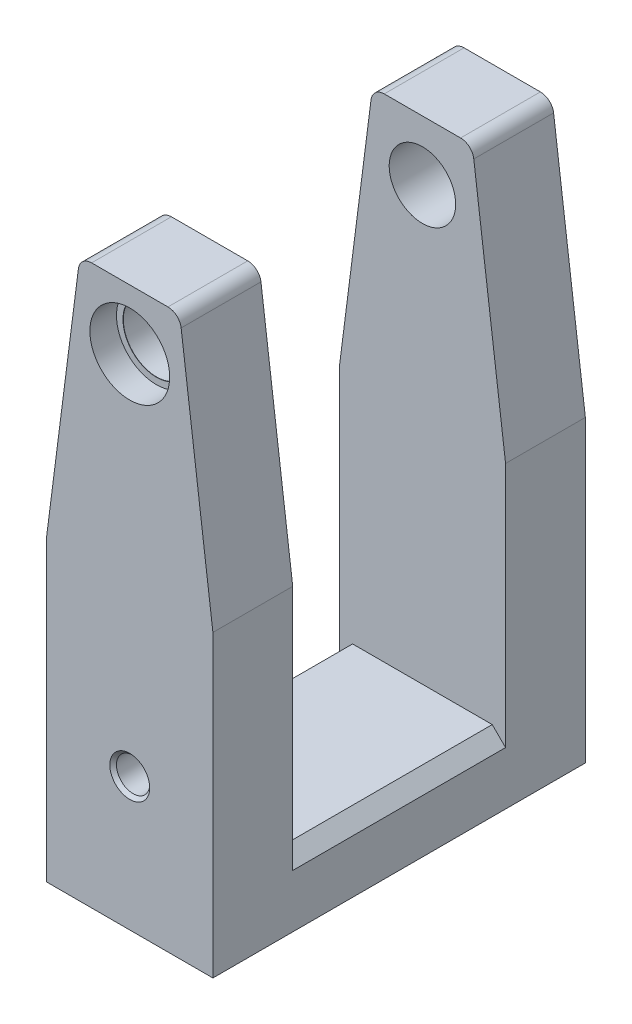
ISO-10303-21;
HEADER;
FILE_DESCRIPTION(('STEP AP214'),'2;1');
FILE_NAME('part.step','',(''),(''),'','','');
FILE_SCHEMA(('AUTOMOTIVE_DESIGN { 1 0 10303 214 1 1 1 1 }'));
ENDSEC;
DATA;
#1=APPLICATION_CONTEXT('core data for automotive mechanical design processes');
#2=APPLICATION_PROTOCOL_DEFINITION('international standard','automotive_design',2000,#1);
#3=PRODUCT_CONTEXT('',#1,'mechanical');
#4=PRODUCT('Part','Part','',(#3));
#5=PRODUCT_RELATED_PRODUCT_CATEGORY('part','',(#4));
#6=PRODUCT_DEFINITION_FORMATION('','',#4);
#7=PRODUCT_DEFINITION_CONTEXT('part definition',#1,'design');
#8=PRODUCT_DEFINITION('design','',#6,#7);
#9=PRODUCT_DEFINITION_SHAPE('','',#8);
#10=(LENGTH_UNIT() NAMED_UNIT(*) SI_UNIT(.MILLI.,.METRE.));
#11=(NAMED_UNIT(*) PLANE_ANGLE_UNIT() SI_UNIT($,.RADIAN.));
#12=(NAMED_UNIT(*) SI_UNIT($,.STERADIAN.) SOLID_ANGLE_UNIT());
#13=UNCERTAINTY_MEASURE_WITH_UNIT(LENGTH_MEASURE(1.E-05),#10,'distance_accuracy_value','');
#14=(GEOMETRIC_REPRESENTATION_CONTEXT(3) GLOBAL_UNCERTAINTY_ASSIGNED_CONTEXT((#13)) GLOBAL_UNIT_ASSIGNED_CONTEXT((#10,
#11,#12)) REPRESENTATION_CONTEXT('',''));
#15=CARTESIAN_POINT('',(0.,0.,0.));
#16=DIRECTION('',(0.,0.,1.));
#17=DIRECTION('',(1.,0.,0.));
#18=AXIS2_PLACEMENT_3D('',#15,#16,#17);
#19=CARTESIAN_POINT('',(7.5,84.,28.));
#20=DIRECTION('',(-0.991881664685851,-0.127164315985366,0.));
#21=DIRECTION('',(0.127164315985366,-0.991881664685851,0.));
#22=AXIS2_PLACEMENT_3D('',#19,#20,#21);
#23=PLANE('',#22);
#24=DIRECTION('',(-0.127164315985366,0.991881664685851,0.));
#25=VECTOR('',#24,1.);
#26=CARTESIAN_POINT('',(7.5,84.,16.));
#27=LINE('',#26,#25);
#28=CARTESIAN_POINT('',(12.5,45.,16.));
#29=VERTEX_POINT('',#28);
#30=CARTESIAN_POINT('',(7.72380402154221,82.2543286319707,16.));
#31=VERTEX_POINT('',#30);
#32=EDGE_CURVE('E305',#29,#31,#27,.T.);
#33=ORIENTED_EDGE('',*,*,#32,.T.);
#34=DIRECTION('',(0.,0.,-1.));
#35=VECTOR('',#34,1.);
#36=CARTESIAN_POINT('',(7.72380402154221,82.2543286319707,28.));
#37=LINE('',#36,#35);
#38=CARTESIAN_POINT('',(7.72380402154221,82.2543286319707,28.));
#39=VERTEX_POINT('',#38);
#40=EDGE_CURVE('E49',#31,#39,#37,.F.);
#41=ORIENTED_EDGE('',*,*,#40,.T.);
#42=DIRECTION('',(-0.127164315985366,0.99188166468585,0.));
#43=VECTOR('',#42,1.);
#44=CARTESIAN_POINT('',(7.5,84.,28.));
#45=LINE('',#44,#43);
#46=CARTESIAN_POINT('',(12.5,45.,28.));
#47=VERTEX_POINT('',#46);
#48=EDGE_CURVE('E310',#47,#39,#45,.T.);
#49=ORIENTED_EDGE('',*,*,#48,.F.);
#50=DIRECTION('',(0.,0.,-1.));
#51=VECTOR('',#50,1.);
#52=CARTESIAN_POINT('',(12.5,45.,28.));
#53=LINE('',#52,#51);
#54=EDGE_CURVE('E197',#47,#29,#53,.T.);
#55=ORIENTED_EDGE('',*,*,#54,.T.);
#56=EDGE_LOOP('',(#33,#41,#49,#55));
#57=FACE_BOUND('',#56,.T.);
#58=ADVANCED_FACE('F41',(#57),#23,.F.);
#59=CARTESIAN_POINT('',(-7.5,84.,28.));
#60=DIRECTION('',(0.,-1.,0.));
#61=DIRECTION('',(0.,0.,-1.));
#62=AXIS2_PLACEMENT_3D('',#59,#60,#61);
#63=PLANE('',#62);
#64=DIRECTION('',(1.,0.,0.));
#65=VECTOR('',#64,1.);
#66=CARTESIAN_POINT('',(-12.5,84.,16.));
#67=LINE('',#66,#65);
#68=CARTESIAN_POINT('',(-5.74004069217051,84.,16.));
#69=VERTEX_POINT('',#68);
#70=CARTESIAN_POINT('',(5.74004069217051,84.,16.));
#71=VERTEX_POINT('',#70);
#72=EDGE_CURVE('E287',#69,#71,#67,.T.);
#73=ORIENTED_EDGE('',*,*,#72,.F.);
#74=DIRECTION('',(0.,0.,-1.));
#75=VECTOR('',#74,1.);
#76=CARTESIAN_POINT('',(-5.74004069217051,84.,28.));
#77=LINE('',#76,#75);
#78=CARTESIAN_POINT('',(-5.74004069217051,84.,28.));
#79=VERTEX_POINT('',#78);
#80=EDGE_CURVE('E63',#69,#79,#77,.F.);
#81=ORIENTED_EDGE('',*,*,#80,.T.);
#82=DIRECTION('',(-1.,0.,0.));
#83=VECTOR('',#82,1.);
#84=CARTESIAN_POINT('',(-7.5,84.,28.));
#85=LINE('',#84,#83);
#86=CARTESIAN_POINT('',(5.74004069217051,84.,28.));
#87=VERTEX_POINT('',#86);
#88=EDGE_CURVE('E274',#87,#79,#85,.T.);
#89=ORIENTED_EDGE('',*,*,#88,.F.);
#90=DIRECTION('',(0.,0.,-1.));
#91=VECTOR('',#90,1.);
#92=CARTESIAN_POINT('',(5.74004069217051,84.,28.));
#93=LINE('',#92,#91);
#94=EDGE_CURVE('E261',#87,#71,#93,.T.);
#95=ORIENTED_EDGE('',*,*,#94,.T.);
#96=EDGE_LOOP('',(#73,#81,#89,#95));
#97=FACE_BOUND('',#96,.T.);
#98=ADVANCED_FACE('F289',(#97),#63,.F.);
#99=CARTESIAN_POINT('',(-12.5,45.,28.));
#100=DIRECTION('',(0.991881664685851,-0.127164315985366,0.));
#101=DIRECTION('',(0.127164315985366,0.991881664685851,0.));
#102=AXIS2_PLACEMENT_3D('',#99,#100,#101);
#103=PLANE('',#102);
#104=DIRECTION('',(-0.127164315985366,-0.99188166468585,0.));
#105=VECTOR('',#104,1.);
#106=CARTESIAN_POINT('',(-12.5,45.,28.));
#107=LINE('',#106,#105);
#108=CARTESIAN_POINT('',(-7.72380402154221,82.2543286319707,28.));
#109=VERTEX_POINT('',#108);
#110=CARTESIAN_POINT('',(-12.5,45.,28.));
#111=VERTEX_POINT('',#110);
#112=EDGE_CURVE('E272',#109,#111,#107,.T.);
#113=ORIENTED_EDGE('',*,*,#112,.F.);
#114=DIRECTION('',(0.,0.,-1.));
#115=VECTOR('',#114,1.);
#116=CARTESIAN_POINT('',(-7.72380402154221,82.2543286319707,28.));
#117=LINE('',#116,#115);
#118=CARTESIAN_POINT('',(-7.72380402154221,82.2543286319707,16.));
#119=VERTEX_POINT('',#118);
#120=EDGE_CURVE('E254',#109,#119,#117,.T.);
#121=ORIENTED_EDGE('',*,*,#120,.T.);
#122=DIRECTION('',(-0.127164315985366,-0.991881664685851,0.));
#123=VECTOR('',#122,1.);
#124=CARTESIAN_POINT('',(-12.5,45.,16.));
#125=LINE('',#124,#123);
#126=CARTESIAN_POINT('',(-12.5,45.,16.));
#127=VERTEX_POINT('',#126);
#128=EDGE_CURVE('E178',#119,#127,#125,.T.);
#129=ORIENTED_EDGE('',*,*,#128,.T.);
#130=DIRECTION('',(0.,0.,-1.));
#131=VECTOR('',#130,1.);
#132=CARTESIAN_POINT('',(-12.5,45.,28.));
#133=LINE('',#132,#131);
#134=EDGE_CURVE('E198',#111,#127,#133,.T.);
#135=ORIENTED_EDGE('',*,*,#134,.F.);
#136=EDGE_LOOP('',(#113,#121,#129,#135));
#137=FACE_BOUND('',#136,.T.);
#138=ADVANCED_FACE('F278',(#137),#103,.F.);
#139=CARTESIAN_POINT('',(12.5,45.,28.));
#140=DIRECTION('',(-1.,0.,0.));
#141=DIRECTION('',(0.,0.,1.));
#142=AXIS2_PLACEMENT_3D('',#139,#140,#141);
#143=PLANE('',#142);
#144=DIRECTION('',(0.,1.,0.));
#145=VECTOR('',#144,1.);
#146=CARTESIAN_POINT('',(12.5,84.,-16.));
#147=LINE('',#146,#145);
#148=CARTESIAN_POINT('',(12.5,8.,-16.));
#149=VERTEX_POINT('',#148);
#150=CARTESIAN_POINT('',(12.5,45.,-16.));
#151=VERTEX_POINT('',#150);
#152=EDGE_CURVE('E182',#149,#151,#147,.T.);
#153=ORIENTED_EDGE('',*,*,#152,.F.);
#154=DIRECTION('',(0.,0.,1.));
#155=VECTOR('',#154,1.);
#156=CARTESIAN_POINT('',(12.5,7.99999999999999,28.));
#157=LINE('',#156,#155);
#158=CARTESIAN_POINT('',(12.5,7.99999999999999,16.));
#159=VERTEX_POINT('',#158);
#160=EDGE_CURVE('E230',#149,#159,#157,.T.);
#161=ORIENTED_EDGE('',*,*,#160,.T.);
#162=DIRECTION('',(0.,-1.,0.));
#163=VECTOR('',#162,1.);
#164=CARTESIAN_POINT('',(12.5,84.,16.));
#165=LINE('',#164,#163);
#166=EDGE_CURVE('E190',#29,#159,#165,.T.);
#167=ORIENTED_EDGE('',*,*,#166,.F.);
#168=ORIENTED_EDGE('',*,*,#54,.F.);
#169=DIRECTION('',(0.,1.,0.));
#170=VECTOR('',#169,1.);
#171=CARTESIAN_POINT('',(12.5,45.,28.));
#172=LINE('',#171,#170);
#173=CARTESIAN_POINT('',(12.5,0.,28.));
#174=VERTEX_POINT('',#173);
#175=EDGE_CURVE('E307',#174,#47,#172,.T.);
#176=ORIENTED_EDGE('',*,*,#175,.F.);
#177=DIRECTION('',(0.,0.,-1.));
#178=VECTOR('',#177,1.);
#179=CARTESIAN_POINT('',(12.5,0.,28.));
#180=LINE('',#179,#178);
#181=CARTESIAN_POINT('',(12.5,0.,-28.));
#182=VERTEX_POINT('',#181);
#183=EDGE_CURVE('E317',#174,#182,#180,.T.);
#184=ORIENTED_EDGE('',*,*,#183,.T.);
#185=DIRECTION('',(0.,1.,0.));
#186=VECTOR('',#185,1.);
#187=CARTESIAN_POINT('',(12.5,45.,-28.));
#188=LINE('',#187,#186);
#189=CARTESIAN_POINT('',(12.5,45.,-28.));
#190=VERTEX_POINT('',#189);
#191=EDGE_CURVE('E196',#182,#190,#188,.T.);
#192=ORIENTED_EDGE('',*,*,#191,.T.);
#193=EDGE_CURVE('E172',#151,#190,#53,.T.);
#194=ORIENTED_EDGE('',*,*,#193,.F.);
#195=EDGE_LOOP('',(#153,#161,#167,#168,#176,#184,#192,#194));
#196=FACE_BOUND('',#195,.T.);
#197=ADVANCED_FACE('F193',(#196),#143,.F.);
#198=DIRECTION('',(-0.127164315985366,0.99188166468585,0.));
#199=VECTOR('',#198,1.);
#200=CARTESIAN_POINT('',(7.5,84.,-28.));
#201=LINE('',#200,#199);
#202=CARTESIAN_POINT('',(7.72380402154221,82.2543286319707,-28.));
#203=VERTEX_POINT('',#202);
#204=EDGE_CURVE('E319',#190,#203,#201,.T.);
#205=ORIENTED_EDGE('',*,*,#204,.T.);
#206=DIRECTION('',(0.,0.,-1.));
#207=VECTOR('',#206,1.);
#208=CARTESIAN_POINT('',(7.72380402154221,82.2543286319707,28.));
#209=LINE('',#208,#207);
#210=CARTESIAN_POINT('',(7.72380402154221,82.2543286319707,-16.));
#211=VERTEX_POINT('',#210);
#212=EDGE_CURVE('E175',#203,#211,#209,.F.);
#213=ORIENTED_EDGE('',*,*,#212,.T.);
#214=DIRECTION('',(0.127164315985366,-0.991881664685851,0.));
#215=VECTOR('',#214,1.);
#216=CARTESIAN_POINT('',(7.5,84.,-16.));
#217=LINE('',#216,#215);
#218=EDGE_CURVE('E167',#211,#151,#217,.T.);
#219=ORIENTED_EDGE('',*,*,#218,.T.);
#220=ORIENTED_EDGE('',*,*,#193,.T.);
#221=EDGE_LOOP('',(#205,#213,#219,#220));
#222=FACE_BOUND('',#221,.T.);
#223=ADVANCED_FACE('F170',(#222),#23,.F.);
#224=DIRECTION('',(1.,0.,0.));
#225=VECTOR('',#224,1.);
#226=CARTESIAN_POINT('',(-12.5,84.,-16.));
#227=LINE('',#226,#225);
#228=CARTESIAN_POINT('',(-5.74004069217051,84.,-16.));
#229=VERTEX_POINT('',#228);
#230=CARTESIAN_POINT('',(5.74004069217051,84.,-16.));
#231=VERTEX_POINT('',#230);
#232=EDGE_CURVE('E291',#229,#231,#227,.T.);
#233=ORIENTED_EDGE('',*,*,#232,.T.);
#234=DIRECTION('',(0.,0.,-1.));
#235=VECTOR('',#234,1.);
#236=CARTESIAN_POINT('',(5.74004069217051,84.,28.));
#237=LINE('',#236,#235);
#238=CARTESIAN_POINT('',(5.74004069217051,84.,-28.));
#239=VERTEX_POINT('',#238);
#240=EDGE_CURVE('E242',#231,#239,#237,.T.);
#241=ORIENTED_EDGE('',*,*,#240,.T.);
#242=DIRECTION('',(-1.,0.,0.));
#243=VECTOR('',#242,1.);
#244=CARTESIAN_POINT('',(-7.5,84.,-28.));
#245=LINE('',#244,#243);
#246=CARTESIAN_POINT('',(-5.74004069217051,84.,-28.));
#247=VERTEX_POINT('',#246);
#248=EDGE_CURVE('E321',#239,#247,#245,.T.);
#249=ORIENTED_EDGE('',*,*,#248,.T.);
#250=DIRECTION('',(0.,0.,-1.));
#251=VECTOR('',#250,1.);
#252=CARTESIAN_POINT('',(-5.74004069217051,84.,28.));
#253=LINE('',#252,#251);
#254=EDGE_CURVE('E240',#247,#229,#253,.F.);
#255=ORIENTED_EDGE('',*,*,#254,.T.);
#256=EDGE_LOOP('',(#233,#241,#249,#255));
#257=FACE_BOUND('',#256,.T.);
#258=ADVANCED_FACE('F382',(#257),#63,.F.);
#259=DIRECTION('',(0.127164315985366,0.991881664685851,0.));
#260=VECTOR('',#259,1.);
#261=CARTESIAN_POINT('',(-12.5,45.,-16.));
#262=LINE('',#261,#260);
#263=CARTESIAN_POINT('',(-12.5,45.,-16.));
#264=VERTEX_POINT('',#263);
#265=CARTESIAN_POINT('',(-7.72380402154221,82.2543286319707,-16.));
#266=VERTEX_POINT('',#265);
#267=EDGE_CURVE('E179',#264,#266,#262,.T.);
#268=ORIENTED_EDGE('',*,*,#267,.T.);
#269=DIRECTION('',(0.,0.,-1.));
#270=VECTOR('',#269,1.);
#271=CARTESIAN_POINT('',(-7.72380402154221,82.2543286319707,28.));
#272=LINE('',#271,#270);
#273=CARTESIAN_POINT('',(-7.72380402154221,82.2543286319707,-28.));
#274=VERTEX_POINT('',#273);
#275=EDGE_CURVE('E11',#266,#274,#272,.T.);
#276=ORIENTED_EDGE('',*,*,#275,.T.);
#277=DIRECTION('',(-0.127164315985366,-0.99188166468585,0.));
#278=VECTOR('',#277,1.);
#279=CARTESIAN_POINT('',(-12.5,45.,-28.));
#280=LINE('',#279,#278);
#281=CARTESIAN_POINT('',(-12.5,45.,-28.));
#282=VERTEX_POINT('',#281);
#283=EDGE_CURVE('E324',#274,#282,#280,.T.);
#284=ORIENTED_EDGE('',*,*,#283,.T.);
#285=EDGE_CURVE('E203',#264,#282,#133,.T.);
#286=ORIENTED_EDGE('',*,*,#285,.F.);
#287=EDGE_LOOP('',(#268,#276,#284,#286));
#288=FACE_BOUND('',#287,.T.);
#289=ADVANCED_FACE('F389',(#288),#103,.F.);
#290=CARTESIAN_POINT('',(-12.5,0.,28.));
#291=DIRECTION('',(1.,0.,0.));
#292=DIRECTION('',(0.,0.,-1.));
#293=AXIS2_PLACEMENT_3D('',#290,#291,#292);
#294=PLANE('',#293);
#295=DIRECTION('',(0.,0.,-1.));
#296=VECTOR('',#295,1.);
#297=CARTESIAN_POINT('',(-12.5,8.00000000000001,28.));
#298=LINE('',#297,#296);
#299=CARTESIAN_POINT('',(-12.5,8.00000000000001,16.));
#300=VERTEX_POINT('',#299);
#301=CARTESIAN_POINT('',(-12.5,8.00000000000001,-16.));
#302=VERTEX_POINT('',#301);
#303=EDGE_CURVE('E208',#300,#302,#298,.T.);
#304=ORIENTED_EDGE('',*,*,#303,.T.);
#305=DIRECTION('',(0.,1.,0.));
#306=VECTOR('',#305,1.);
#307=CARTESIAN_POINT('',(-12.5,84.,-16.));
#308=LINE('',#307,#306);
#309=EDGE_CURVE('E189',#302,#264,#308,.T.);
#310=ORIENTED_EDGE('',*,*,#309,.T.);
#311=ORIENTED_EDGE('',*,*,#285,.T.);
#312=DIRECTION('',(0.,-1.,0.));
#313=VECTOR('',#312,1.);
#314=CARTESIAN_POINT('',(-12.5,0.,-28.));
#315=LINE('',#314,#313);
#316=CARTESIAN_POINT('',(-12.5,0.,-28.));
#317=VERTEX_POINT('',#316);
#318=EDGE_CURVE('E326',#282,#317,#315,.T.);
#319=ORIENTED_EDGE('',*,*,#318,.T.);
#320=DIRECTION('',(0.,0.,-1.));
#321=VECTOR('',#320,1.);
#322=CARTESIAN_POINT('',(-12.5,0.,28.));
#323=LINE('',#322,#321);
#324=CARTESIAN_POINT('',(-12.5,0.,28.));
#325=VERTEX_POINT('',#324);
#326=EDGE_CURVE('E329',#325,#317,#323,.T.);
#327=ORIENTED_EDGE('',*,*,#326,.F.);
#328=DIRECTION('',(0.,-1.,0.));
#329=VECTOR('',#328,1.);
#330=CARTESIAN_POINT('',(-12.5,0.,28.));
#331=LINE('',#330,#329);
#332=EDGE_CURVE('E281',#111,#325,#331,.T.);
#333=ORIENTED_EDGE('',*,*,#332,.F.);
#334=ORIENTED_EDGE('',*,*,#134,.T.);
#335=DIRECTION('',(0.,-1.,0.));
#336=VECTOR('',#335,1.);
#337=CARTESIAN_POINT('',(-12.5,0.,16.));
#338=LINE('',#337,#336);
#339=EDGE_CURVE('E201',#127,#300,#338,.T.);
#340=ORIENTED_EDGE('',*,*,#339,.T.);
#341=EDGE_LOOP('',(#304,#310,#311,#319,#327,#333,#334,#340));
#342=FACE_BOUND('',#341,.T.);
#343=ADVANCED_FACE('F340',(#342),#294,.F.);
#344=CARTESIAN_POINT('',(12.5,0.,28.));
#345=DIRECTION('',(0.,1.,0.));
#346=DIRECTION('',(0.,0.,1.));
#347=AXIS2_PLACEMENT_3D('',#344,#345,#346);
#348=PLANE('',#347);
#349=DIRECTION('',(1.,0.,0.));
#350=VECTOR('',#349,1.);
#351=CARTESIAN_POINT('',(12.5,0.,-28.));
#352=LINE('',#351,#350);
#353=EDGE_CURVE('E311',#317,#182,#352,.T.);
#354=ORIENTED_EDGE('',*,*,#353,.T.);
#355=ORIENTED_EDGE('',*,*,#183,.F.);
#356=DIRECTION('',(1.,0.,0.));
#357=VECTOR('',#356,1.);
#358=CARTESIAN_POINT('',(12.5,0.,28.));
#359=LINE('',#358,#357);
#360=EDGE_CURVE('E315',#325,#174,#359,.T.);
#361=ORIENTED_EDGE('',*,*,#360,.F.);
#362=ORIENTED_EDGE('',*,*,#326,.T.);
#363=EDGE_LOOP('',(#354,#355,#361,#362));
#364=FACE_BOUND('',#363,.T.);
#365=ADVANCED_FACE('F347',(#364),#348,.F.);
#366=CARTESIAN_POINT('',(0.,0.,28.));
#367=DIRECTION('',(0.,0.,-1.));
#368=DIRECTION('',(-1.,0.,0.));
#369=AXIS2_PLACEMENT_3D('',#366,#367,#368);
#370=PLANE('',#369);
#371=CARTESIAN_POINT('',(0.,20.,28.));
#372=DIRECTION('',(0.,0.,1.));
#373=DIRECTION('',(1.,0.,0.));
#374=AXIS2_PLACEMENT_3D('',#371,#372,#373);
#375=CIRCLE('',#374,3.);
#376=CARTESIAN_POINT('',(3.,20.,28.));
#377=VERTEX_POINT('',#376);
#378=EDGE_CURVE('E477',#377,#377,#375,.T.);
#379=ORIENTED_EDGE('',*,*,#378,.F.);
#380=EDGE_LOOP('',(#379));
#381=FACE_BOUND('',#380,.T.);
#382=CARTESIAN_POINT('',(0.,75.,28.));
#383=DIRECTION('',(0.,0.,1.));
#384=DIRECTION('',(1.,0.,0.));
#385=AXIS2_PLACEMENT_3D('',#382,#383,#384);
#386=CIRCLE('',#385,5.99999999999999);
#387=CARTESIAN_POINT('',(6.,75.,28.));
#388=VERTEX_POINT('',#387);
#389=EDGE_CURVE('E216',#388,#388,#386,.T.);
#390=ORIENTED_EDGE('',*,*,#389,.F.);
#391=EDGE_LOOP('',(#390));
#392=FACE_BOUND('',#391,.T.);
#393=ORIENTED_EDGE('',*,*,#88,.T.);
#394=CARTESIAN_POINT('',(-5.74004069217051,82.,28.));
#395=DIRECTION('',(0.,0.,-1.));
#396=DIRECTION('',(-1.,0.,0.));
#397=AXIS2_PLACEMENT_3D('',#394,#395,#396);
#398=CIRCLE('',#397,2.);
#399=EDGE_CURVE('E267',#79,#109,#398,.F.);
#400=ORIENTED_EDGE('',*,*,#399,.T.);
#401=ORIENTED_EDGE('',*,*,#112,.T.);
#402=ORIENTED_EDGE('',*,*,#332,.T.);
#403=ORIENTED_EDGE('',*,*,#360,.T.);
#404=ORIENTED_EDGE('',*,*,#175,.T.);
#405=ORIENTED_EDGE('',*,*,#48,.T.);
#406=CARTESIAN_POINT('',(5.74004069217051,82.,28.));
#407=DIRECTION('',(0.,0.,-1.));
#408=DIRECTION('',(-1.,0.,0.));
#409=AXIS2_PLACEMENT_3D('',#406,#407,#408);
#410=CIRCLE('',#409,2.);
#411=EDGE_CURVE('E265',#39,#87,#410,.F.);
#412=ORIENTED_EDGE('',*,*,#411,.T.);
#413=EDGE_LOOP('',(#393,#400,#401,#402,#403,#404,#405,#412));
#414=FACE_BOUND('',#413,.T.);
#415=ADVANCED_FACE('F271',(#381,#392,#414),#370,.F.);
#416=CARTESIAN_POINT('',(0.,0.,-28.));
#417=DIRECTION('',(0.,0.,-1.));
#418=DIRECTION('',(-1.,0.,0.));
#419=AXIS2_PLACEMENT_3D('',#416,#417,#418);
#420=PLANE('',#419);
#421=CARTESIAN_POINT('',(0.,75.,-28.));
#422=DIRECTION('',(0.,0.,-1.));
#423=DIRECTION('',(-1.,0.,0.));
#424=AXIS2_PLACEMENT_3D('',#421,#422,#423);
#425=CIRCLE('',#424,5.99999999999999);
#426=CARTESIAN_POINT('',(-5.99999999999999,75.,-28.));
#427=VERTEX_POINT('',#426);
#428=EDGE_CURVE('E221',#427,#427,#425,.T.);
#429=ORIENTED_EDGE('',*,*,#428,.F.);
#430=EDGE_LOOP('',(#429));
#431=FACE_BOUND('',#430,.T.);
#432=ORIENTED_EDGE('',*,*,#248,.F.);
#433=CARTESIAN_POINT('',(5.74004069217051,82.,-28.));
#434=DIRECTION('',(0.,0.,-1.));
#435=DIRECTION('',(-1.,0.,0.));
#436=AXIS2_PLACEMENT_3D('',#433,#434,#435);
#437=CIRCLE('',#436,2.);
#438=EDGE_CURVE('E247',#239,#203,#437,.T.);
#439=ORIENTED_EDGE('',*,*,#438,.T.);
#440=ORIENTED_EDGE('',*,*,#204,.F.);
#441=ORIENTED_EDGE('',*,*,#191,.F.);
#442=ORIENTED_EDGE('',*,*,#353,.F.);
#443=ORIENTED_EDGE('',*,*,#318,.F.);
#444=ORIENTED_EDGE('',*,*,#283,.F.);
#445=CARTESIAN_POINT('',(-5.74004069217051,82.,-28.));
#446=DIRECTION('',(0.,0.,-1.));
#447=DIRECTION('',(-1.,0.,0.));
#448=AXIS2_PLACEMENT_3D('',#445,#446,#447);
#449=CIRCLE('',#448,2.);
#450=EDGE_CURVE('E245',#274,#247,#449,.T.);
#451=ORIENTED_EDGE('',*,*,#450,.T.);
#452=EDGE_LOOP('',(#432,#439,#440,#441,#442,#443,#444,#451));
#453=FACE_BOUND('',#452,.T.);
#454=ADVANCED_FACE('F345',(#431,#453),#420,.T.);
#455=CARTESIAN_POINT('',(-12.5,84.,16.));
#456=DIRECTION('',(0.,0.,1.));
#457=DIRECTION('',(0.,-1.,0.));
#458=AXIS2_PLACEMENT_3D('',#455,#456,#457);
#459=PLANE('',#458);
#460=CARTESIAN_POINT('',(0.,20.,16.));
#461=DIRECTION('',(0.,0.,1.));
#462=DIRECTION('',(0.,-1.,0.));
#463=AXIS2_PLACEMENT_3D('',#460,#461,#462);
#464=CIRCLE('',#463,2.5);
#465=CARTESIAN_POINT('',(0.,17.5,16.));
#466=VERTEX_POINT('',#465);
#467=EDGE_CURVE('E218',#466,#466,#464,.T.);
#468=ORIENTED_EDGE('',*,*,#467,.T.);
#469=EDGE_LOOP('',(#468));
#470=FACE_BOUND('',#469,.T.);
#471=CARTESIAN_POINT('',(0.,75.,16.));
#472=DIRECTION('',(0.,0.,1.));
#473=DIRECTION('',(0.,-1.,0.));
#474=AXIS2_PLACEMENT_3D('',#471,#472,#473);
#475=CIRCLE('',#474,5.);
#476=CARTESIAN_POINT('',(0.,70.,16.));
#477=VERTEX_POINT('',#476);
#478=EDGE_CURVE('E209',#477,#477,#475,.T.);
#479=ORIENTED_EDGE('',*,*,#478,.T.);
#480=EDGE_LOOP('',(#479));
#481=FACE_BOUND('',#480,.T.);
#482=ORIENTED_EDGE('',*,*,#128,.F.);
#483=CARTESIAN_POINT('',(-5.74004069217051,82.,16.));
#484=DIRECTION('',(0.,0.,1.));
#485=DIRECTION('',(0.,-1.,0.));
#486=AXIS2_PLACEMENT_3D('',#483,#484,#485);
#487=CIRCLE('',#486,2.);
#488=EDGE_CURVE('E259',#119,#69,#487,.F.);
#489=ORIENTED_EDGE('',*,*,#488,.T.);
#490=ORIENTED_EDGE('',*,*,#72,.T.);
#491=CARTESIAN_POINT('',(5.74004069217051,82.,16.));
#492=DIRECTION('',(0.,0.,1.));
#493=DIRECTION('',(0.,-1.,0.));
#494=AXIS2_PLACEMENT_3D('',#491,#492,#493);
#495=CIRCLE('',#494,2.);
#496=EDGE_CURVE('E257',#71,#31,#495,.F.);
#497=ORIENTED_EDGE('',*,*,#496,.T.);
#498=ORIENTED_EDGE('',*,*,#32,.F.);
#499=ORIENTED_EDGE('',*,*,#166,.T.);
#500=DIRECTION('',(0.707106781186545,-0.70710678118655,0.));
#501=VECTOR('',#500,1.);
#502=CARTESIAN_POINT('',(-37.9999999999999,58.5000000000003,16.));
#503=LINE('',#502,#501);
#504=CARTESIAN_POINT('',(10.5,9.99999999999999,16.));
#505=VERTEX_POINT('',#504);
#506=EDGE_CURVE('E238',#159,#505,#503,.F.);
#507=ORIENTED_EDGE('',*,*,#506,.T.);
#508=DIRECTION('',(1.,0.,0.));
#509=VECTOR('',#508,1.);
#510=CARTESIAN_POINT('',(-12.5,9.99999999999999,16.));
#511=LINE('',#510,#509);
#512=CARTESIAN_POINT('',(-10.5,9.99999999999999,16.));
#513=VERTEX_POINT('',#512);
#514=EDGE_CURVE('E301',#513,#505,#511,.T.);
#515=ORIENTED_EDGE('',*,*,#514,.F.);
#516=DIRECTION('',(0.70710678118655,0.707106781186545,0.));
#517=VECTOR('',#516,1.);
#518=CARTESIAN_POINT('',(25.5,45.9999999999998,16.));
#519=LINE('',#518,#517);
#520=EDGE_CURVE('E234',#513,#300,#519,.F.);
#521=ORIENTED_EDGE('',*,*,#520,.T.);
#522=ORIENTED_EDGE('',*,*,#339,.F.);
#523=EDGE_LOOP('',(#482,#489,#490,#497,#498,#499,#507,#515,#521,#522));
#524=FACE_BOUND('',#523,.T.);
#525=ADVANCED_FACE('F286',(#470,#481,#524),#459,.F.);
#526=CARTESIAN_POINT('',(-12.5,84.,-16.));
#527=DIRECTION('',(0.,0.,-1.));
#528=DIRECTION('',(0.,1.,0.));
#529=AXIS2_PLACEMENT_3D('',#526,#527,#528);
#530=PLANE('',#529);
#531=CARTESIAN_POINT('',(0.,75.,-16.));
#532=DIRECTION('',(0.,0.,-1.));
#533=DIRECTION('',(0.,1.,0.));
#534=AXIS2_PLACEMENT_3D('',#531,#532,#533);
#535=CIRCLE('',#534,5.);
#536=CARTESIAN_POINT('',(0.,80.,-16.));
#537=VERTEX_POINT('',#536);
#538=EDGE_CURVE('E213',#537,#537,#535,.T.);
#539=ORIENTED_EDGE('',*,*,#538,.T.);
#540=EDGE_LOOP('',(#539));
#541=FACE_BOUND('',#540,.T.);
#542=ORIENTED_EDGE('',*,*,#218,.F.);
#543=CARTESIAN_POINT('',(5.74004069217051,82.,-16.));
#544=DIRECTION('',(0.,0.,-1.));
#545=DIRECTION('',(0.,1.,0.));
#546=AXIS2_PLACEMENT_3D('',#543,#544,#545);
#547=CIRCLE('',#546,2.);
#548=EDGE_CURVE('E252',#211,#231,#547,.F.);
#549=ORIENTED_EDGE('',*,*,#548,.T.);
#550=ORIENTED_EDGE('',*,*,#232,.F.);
#551=CARTESIAN_POINT('',(-5.74004069217051,82.,-16.));
#552=DIRECTION('',(0.,0.,-1.));
#553=DIRECTION('',(0.,1.,0.));
#554=AXIS2_PLACEMENT_3D('',#551,#552,#553);
#555=CIRCLE('',#554,2.);
#556=EDGE_CURVE('E250',#229,#266,#555,.F.);
#557=ORIENTED_EDGE('',*,*,#556,.T.);
#558=ORIENTED_EDGE('',*,*,#267,.F.);
#559=ORIENTED_EDGE('',*,*,#309,.F.);
#560=DIRECTION('',(-0.70710678118655,-0.707106781186545,0.));
#561=VECTOR('',#560,1.);
#562=CARTESIAN_POINT('',(25.5,45.9999999999998,-16.));
#563=LINE('',#562,#561);
#564=CARTESIAN_POINT('',(-10.5,10.,-16.));
#565=VERTEX_POINT('',#564);
#566=EDGE_CURVE('E232',#302,#565,#563,.F.);
#567=ORIENTED_EDGE('',*,*,#566,.T.);
#568=DIRECTION('',(1.,0.,0.));
#569=VECTOR('',#568,1.);
#570=CARTESIAN_POINT('',(-12.5,10.,-16.));
#571=LINE('',#570,#569);
#572=CARTESIAN_POINT('',(10.5,10.,-16.));
#573=VERTEX_POINT('',#572);
#574=EDGE_CURVE('E296',#565,#573,#571,.T.);
#575=ORIENTED_EDGE('',*,*,#574,.T.);
#576=DIRECTION('',(-0.707106781186545,0.70710678118655,0.));
#577=VECTOR('',#576,1.);
#578=CARTESIAN_POINT('',(-37.9999999999999,58.5000000000003,-16.));
#579=LINE('',#578,#577);
#580=EDGE_CURVE('E185',#573,#149,#579,.F.);
#581=ORIENTED_EDGE('',*,*,#580,.T.);
#582=ORIENTED_EDGE('',*,*,#152,.T.);
#583=EDGE_LOOP('',(#542,#549,#550,#557,#558,#559,#567,#575,#581,#582));
#584=FACE_BOUND('',#583,.T.);
#585=ADVANCED_FACE('F183',(#541,#584),#530,.F.);
#586=CARTESIAN_POINT('',(-12.5,9.99999999999999,16.));
#587=DIRECTION('',(0.,-1.,0.));
#588=DIRECTION('',(0.,0.,-1.));
#589=AXIS2_PLACEMENT_3D('',#586,#587,#588);
#590=PLANE('',#589);
#591=ORIENTED_EDGE('',*,*,#574,.F.);
#592=DIRECTION('',(0.,0.,1.));
#593=VECTOR('',#592,1.);
#594=CARTESIAN_POINT('',(-10.5,9.99999999999999,16.));
#595=LINE('',#594,#593);
#596=EDGE_CURVE('E228',#565,#513,#595,.T.);
#597=ORIENTED_EDGE('',*,*,#596,.T.);
#598=ORIENTED_EDGE('',*,*,#514,.T.);
#599=DIRECTION('',(0.,0.,-1.));
#600=VECTOR('',#599,1.);
#601=CARTESIAN_POINT('',(10.5,9.99999999999999,16.));
#602=LINE('',#601,#600);
#603=EDGE_CURVE('E225',#505,#573,#602,.T.);
#604=ORIENTED_EDGE('',*,*,#603,.T.);
#605=EDGE_LOOP('',(#591,#597,#598,#604));
#606=FACE_BOUND('',#605,.T.);
#607=ADVANCED_FACE('F361',(#606),#590,.F.);
#608=CARTESIAN_POINT('',(0.,75.,28.));
#609=DIRECTION('',(0.,0.,1.));
#610=DIRECTION('',(1.,0.,0.));
#611=AXIS2_PLACEMENT_3D('',#608,#609,#610);
#612=CYLINDRICAL_SURFACE('',#611,5.);
#613=CARTESIAN_POINT('',(0.,75.,23.975));
#614=DIRECTION('',(0.,0.,1.));
#615=DIRECTION('',(1.,0.,0.));
#616=AXIS2_PLACEMENT_3D('',#613,#614,#615);
#617=CIRCLE('',#616,5.);
#618=CARTESIAN_POINT('',(5.,75.,23.975));
#619=VERTEX_POINT('',#618);
#620=EDGE_CURVE('E212',#619,#619,#617,.T.);
#621=ORIENTED_EDGE('',*,*,#620,.T.);
#622=EDGE_LOOP('',(#621));
#623=FACE_BOUND('',#622,.T.);
#624=ORIENTED_EDGE('',*,*,#478,.F.);
#625=EDGE_LOOP('',(#624));
#626=FACE_BOUND('',#625,.T.);
#627=ADVANCED_FACE('F429',(#623,#626),#612,.F.);
#628=CARTESIAN_POINT('',(0.,75.,24.));
#629=DIRECTION('',(0.,0.,1.));
#630=DIRECTION('',(1.,0.,0.));
#631=AXIS2_PLACEMENT_3D('',#628,#629,#630);
#632=CONICAL_SURFACE('',#631,5.025,0.785398163397258);
#633=ORIENTED_EDGE('',*,*,#620,.F.);
#634=EDGE_LOOP('',(#633));
#635=FACE_BOUND('',#634,.T.);
#636=CARTESIAN_POINT('',(0.,75.,24.));
#637=DIRECTION('',(0.,0.,1.));
#638=DIRECTION('',(1.,0.,0.));
#639=AXIS2_PLACEMENT_3D('',#636,#637,#638);
#640=CIRCLE('',#639,5.025);
#641=CARTESIAN_POINT('',(5.025,75.,24.));
#642=VERTEX_POINT('',#641);
#643=EDGE_CURVE('E496',#642,#642,#640,.T.);
#644=ORIENTED_EDGE('',*,*,#643,.T.);
#645=EDGE_LOOP('',(#644));
#646=FACE_BOUND('',#645,.T.);
#647=ADVANCED_FACE('F435',(#635,#646),#632,.F.);
#648=CARTESIAN_POINT('',(5.025,75.,24.));
#649=DIRECTION('',(0.,0.,-1.));
#650=DIRECTION('',(-1.,0.,0.));
#651=AXIS2_PLACEMENT_3D('',#648,#649,#650);
#652=PLANE('',#651);
#653=ORIENTED_EDGE('',*,*,#643,.F.);
#654=EDGE_LOOP('',(#653));
#655=FACE_BOUND('',#654,.T.);
#656=CARTESIAN_POINT('',(0.,75.,24.));
#657=DIRECTION('',(0.,0.,1.));
#658=DIRECTION('',(1.,0.,0.));
#659=AXIS2_PLACEMENT_3D('',#656,#657,#658);
#660=CIRCLE('',#659,6.);
#661=CARTESIAN_POINT('',(6.,75.,24.));
#662=VERTEX_POINT('',#661);
#663=EDGE_CURVE('E493',#662,#662,#660,.T.);
#664=ORIENTED_EDGE('',*,*,#663,.T.);
#665=EDGE_LOOP('',(#664));
#666=FACE_BOUND('',#665,.T.);
#667=ADVANCED_FACE('F439',(#655,#666),#652,.F.);
#668=CARTESIAN_POINT('',(0.,75.,28.));
#669=DIRECTION('',(0.,0.,1.));
#670=DIRECTION('',(1.,0.,0.));
#671=AXIS2_PLACEMENT_3D('',#668,#669,#670);
#672=CYLINDRICAL_SURFACE('',#671,6.);
#673=ORIENTED_EDGE('',*,*,#663,.F.);
#674=EDGE_LOOP('',(#673));
#675=FACE_BOUND('',#674,.T.);
#676=ORIENTED_EDGE('',*,*,#389,.T.);
#677=EDGE_LOOP('',(#676));
#678=FACE_BOUND('',#677,.T.);
#679=ADVANCED_FACE('F443',(#675,#678),#672,.F.);
#680=CARTESIAN_POINT('',(0.,75.,-28.));
#681=DIRECTION('',(0.,0.,-1.));
#682=DIRECTION('',(-1.,0.,0.));
#683=AXIS2_PLACEMENT_3D('',#680,#681,#682);
#684=CYLINDRICAL_SURFACE('',#683,5.);
#685=CARTESIAN_POINT('',(0.,75.,-23.975));
#686=DIRECTION('',(0.,0.,-1.));
#687=DIRECTION('',(-1.,0.,0.));
#688=AXIS2_PLACEMENT_3D('',#685,#686,#687);
#689=CIRCLE('',#688,5.);
#690=CARTESIAN_POINT('',(-5.,75.,-23.975));
#691=VERTEX_POINT('',#690);
#692=EDGE_CURVE('E217',#691,#691,#689,.T.);
#693=ORIENTED_EDGE('',*,*,#692,.T.);
#694=EDGE_LOOP('',(#693));
#695=FACE_BOUND('',#694,.T.);
#696=ORIENTED_EDGE('',*,*,#538,.F.);
#697=EDGE_LOOP('',(#696));
#698=FACE_BOUND('',#697,.T.);
#699=ADVANCED_FACE('F447',(#695,#698),#684,.F.);
#700=CARTESIAN_POINT('',(0.,75.,-24.));
#701=DIRECTION('',(0.,0.,-1.));
#702=DIRECTION('',(-1.,0.,0.));
#703=AXIS2_PLACEMENT_3D('',#700,#701,#702);
#704=CONICAL_SURFACE('',#703,5.025,0.785398163397258);
#705=ORIENTED_EDGE('',*,*,#692,.F.);
#706=EDGE_LOOP('',(#705));
#707=FACE_BOUND('',#706,.T.);
#708=CARTESIAN_POINT('',(0.,75.,-24.));
#709=DIRECTION('',(0.,0.,-1.));
#710=DIRECTION('',(-1.,0.,0.));
#711=AXIS2_PLACEMENT_3D('',#708,#709,#710);
#712=CIRCLE('',#711,5.025);
#713=CARTESIAN_POINT('',(-5.025,75.,-24.));
#714=VERTEX_POINT('',#713);
#715=EDGE_CURVE('E486',#714,#714,#712,.T.);
#716=ORIENTED_EDGE('',*,*,#715,.T.);
#717=EDGE_LOOP('',(#716));
#718=FACE_BOUND('',#717,.T.);
#719=ADVANCED_FACE('F451',(#707,#718),#704,.F.);
#720=CARTESIAN_POINT('',(5.025,75.,-24.));
#721=DIRECTION('',(0.,0.,1.));
#722=DIRECTION('',(1.,0.,0.));
#723=AXIS2_PLACEMENT_3D('',#720,#721,#722);
#724=PLANE('',#723);
#725=ORIENTED_EDGE('',*,*,#715,.F.);
#726=EDGE_LOOP('',(#725));
#727=FACE_BOUND('',#726,.T.);
#728=CARTESIAN_POINT('',(0.,75.,-24.));
#729=DIRECTION('',(0.,0.,-1.));
#730=DIRECTION('',(-1.,0.,0.));
#731=AXIS2_PLACEMENT_3D('',#728,#729,#730);
#732=CIRCLE('',#731,6.);
#733=CARTESIAN_POINT('',(-6.,75.,-24.));
#734=VERTEX_POINT('',#733);
#735=EDGE_CURVE('E483',#734,#734,#732,.T.);
#736=ORIENTED_EDGE('',*,*,#735,.T.);
#737=EDGE_LOOP('',(#736));
#738=FACE_BOUND('',#737,.T.);
#739=ADVANCED_FACE('F455',(#727,#738),#724,.F.);
#740=CARTESIAN_POINT('',(0.,75.,-28.));
#741=DIRECTION('',(0.,0.,-1.));
#742=DIRECTION('',(-1.,0.,0.));
#743=AXIS2_PLACEMENT_3D('',#740,#741,#742);
#744=CYLINDRICAL_SURFACE('',#743,6.);
#745=ORIENTED_EDGE('',*,*,#735,.F.);
#746=EDGE_LOOP('',(#745));
#747=FACE_BOUND('',#746,.T.);
#748=ORIENTED_EDGE('',*,*,#428,.T.);
#749=EDGE_LOOP('',(#748));
#750=FACE_BOUND('',#749,.T.);
#751=ADVANCED_FACE('F459',(#747,#750),#744,.F.);
#752=CARTESIAN_POINT('',(0.,20.,28.));
#753=DIRECTION('',(0.,0.,1.));
#754=DIRECTION('',(1.,0.,0.));
#755=AXIS2_PLACEMENT_3D('',#752,#753,#754);
#756=CYLINDRICAL_SURFACE('',#755,2.5);
#757=CARTESIAN_POINT('',(0.,20.,27.5));
#758=DIRECTION('',(0.,0.,1.));
#759=DIRECTION('',(1.,0.,0.));
#760=AXIS2_PLACEMENT_3D('',#757,#758,#759);
#761=CIRCLE('',#760,2.5);
#762=CARTESIAN_POINT('',(2.5,20.,27.5));
#763=VERTEX_POINT('',#762);
#764=EDGE_CURVE('E222',#763,#763,#761,.T.);
#765=ORIENTED_EDGE('',*,*,#764,.T.);
#766=EDGE_LOOP('',(#765));
#767=FACE_BOUND('',#766,.T.);
#768=ORIENTED_EDGE('',*,*,#467,.F.);
#769=EDGE_LOOP('',(#768));
#770=FACE_BOUND('',#769,.T.);
#771=ADVANCED_FACE('F463',(#767,#770),#756,.F.);
#772=CARTESIAN_POINT('',(0.,20.,28.));
#773=DIRECTION('',(0.,0.,1.));
#774=DIRECTION('',(1.,0.,0.));
#775=AXIS2_PLACEMENT_3D('',#772,#773,#774);
#776=CONICAL_SURFACE('',#775,3.,0.785398163397445);
#777=ORIENTED_EDGE('',*,*,#764,.F.);
#778=EDGE_LOOP('',(#777));
#779=FACE_BOUND('',#778,.T.);
#780=ORIENTED_EDGE('',*,*,#378,.T.);
#781=EDGE_LOOP('',(#780));
#782=FACE_BOUND('',#781,.T.);
#783=ADVANCED_FACE('F398',(#779,#782),#776,.F.);
#784=CARTESIAN_POINT('',(-12.5,8.00000000000001,28.));
#785=DIRECTION('',(0.707106781186545,-0.70710678118655,0.));
#786=DIRECTION('',(0.,0.,-1.));
#787=AXIS2_PLACEMENT_3D('',#784,#785,#786);
#788=PLANE('',#787);
#789=ORIENTED_EDGE('',*,*,#520,.F.);
#790=ORIENTED_EDGE('',*,*,#596,.F.);
#791=ORIENTED_EDGE('',*,*,#566,.F.);
#792=ORIENTED_EDGE('',*,*,#303,.F.);
#793=EDGE_LOOP('',(#789,#790,#791,#792));
#794=FACE_BOUND('',#793,.T.);
#795=ADVANCED_FACE('F358',(#794),#788,.F.);
#796=CARTESIAN_POINT('',(10.5,9.99999999999999,16.));
#797=DIRECTION('',(-0.70710678118655,-0.707106781186545,0.));
#798=DIRECTION('',(0.,0.,-1.));
#799=AXIS2_PLACEMENT_3D('',#796,#797,#798);
#800=PLANE('',#799);
#801=ORIENTED_EDGE('',*,*,#506,.F.);
#802=ORIENTED_EDGE('',*,*,#160,.F.);
#803=ORIENTED_EDGE('',*,*,#580,.F.);
#804=ORIENTED_EDGE('',*,*,#603,.F.);
#805=EDGE_LOOP('',(#801,#802,#803,#804));
#806=FACE_BOUND('',#805,.T.);
#807=ADVANCED_FACE('F365',(#806),#800,.F.);
#808=CARTESIAN_POINT('',(5.74004069217051,82.,28.));
#809=DIRECTION('',(0.,0.,-1.));
#810=DIRECTION('',(-1.,0.,0.));
#811=AXIS2_PLACEMENT_3D('',#808,#809,#810);
#812=CYLINDRICAL_SURFACE('',#811,2.);
#813=ORIENTED_EDGE('',*,*,#548,.F.);
#814=ORIENTED_EDGE('',*,*,#212,.F.);
#815=ORIENTED_EDGE('',*,*,#438,.F.);
#816=ORIENTED_EDGE('',*,*,#240,.F.);
#817=EDGE_LOOP('',(#813,#814,#815,#816));
#818=FACE_BOUND('',#817,.T.);
#819=ADVANCED_FACE('F374',(#818),#812,.T.);
#820=CARTESIAN_POINT('',(-5.74004069217051,82.,28.));
#821=DIRECTION('',(0.,0.,-1.));
#822=DIRECTION('',(-1.,0.,0.));
#823=AXIS2_PLACEMENT_3D('',#820,#821,#822);
#824=CYLINDRICAL_SURFACE('',#823,2.);
#825=ORIENTED_EDGE('',*,*,#399,.F.);
#826=ORIENTED_EDGE('',*,*,#80,.F.);
#827=ORIENTED_EDGE('',*,*,#488,.F.);
#828=ORIENTED_EDGE('',*,*,#120,.F.);
#829=EDGE_LOOP('',(#825,#826,#827,#828));
#830=FACE_BOUND('',#829,.T.);
#831=ADVANCED_FACE('F283',(#830),#824,.T.);
#832=CARTESIAN_POINT('',(5.74004069217051,82.,28.));
#833=DIRECTION('',(0.,0.,-1.));
#834=DIRECTION('',(-1.,0.,0.));
#835=AXIS2_PLACEMENT_3D('',#832,#833,#834);
#836=CYLINDRICAL_SURFACE('',#835,2.);
#837=ORIENTED_EDGE('',*,*,#411,.F.);
#838=ORIENTED_EDGE('',*,*,#40,.F.);
#839=ORIENTED_EDGE('',*,*,#496,.F.);
#840=ORIENTED_EDGE('',*,*,#94,.F.);
#841=EDGE_LOOP('',(#837,#838,#839,#840));
#842=FACE_BOUND('',#841,.T.);
#843=ADVANCED_FACE('F367',(#842),#836,.T.);
#844=CARTESIAN_POINT('',(-5.74004069217051,82.,28.));
#845=DIRECTION('',(0.,0.,-1.));
#846=DIRECTION('',(-1.,0.,0.));
#847=AXIS2_PLACEMENT_3D('',#844,#845,#846);
#848=CYLINDRICAL_SURFACE('',#847,2.);
#849=ORIENTED_EDGE('',*,*,#556,.F.);
#850=ORIENTED_EDGE('',*,*,#254,.F.);
#851=ORIENTED_EDGE('',*,*,#450,.F.);
#852=ORIENTED_EDGE('',*,*,#275,.F.);
#853=EDGE_LOOP('',(#849,#850,#851,#852));
#854=FACE_BOUND('',#853,.T.);
#855=ADVANCED_FACE('F43',(#854),#848,.T.);
#856=CLOSED_SHELL('',(#58,#98,#138,#197,#223,#258,#289,#343,#365,#415,#454,#525,#585,#607,#627,
#647,#667,#679,#699,#719,#739,#751,#771,#783,#795,#807,#819,#831,#843,#855));
#857=MANIFOLD_SOLID_BREP('B2',#856);
#858=ADVANCED_BREP_SHAPE_REPRESENTATION('',(#18,#857),#14);
#859=SHAPE_DEFINITION_REPRESENTATION(#9,#858);
ENDSEC;
END-ISO-10303-21;
